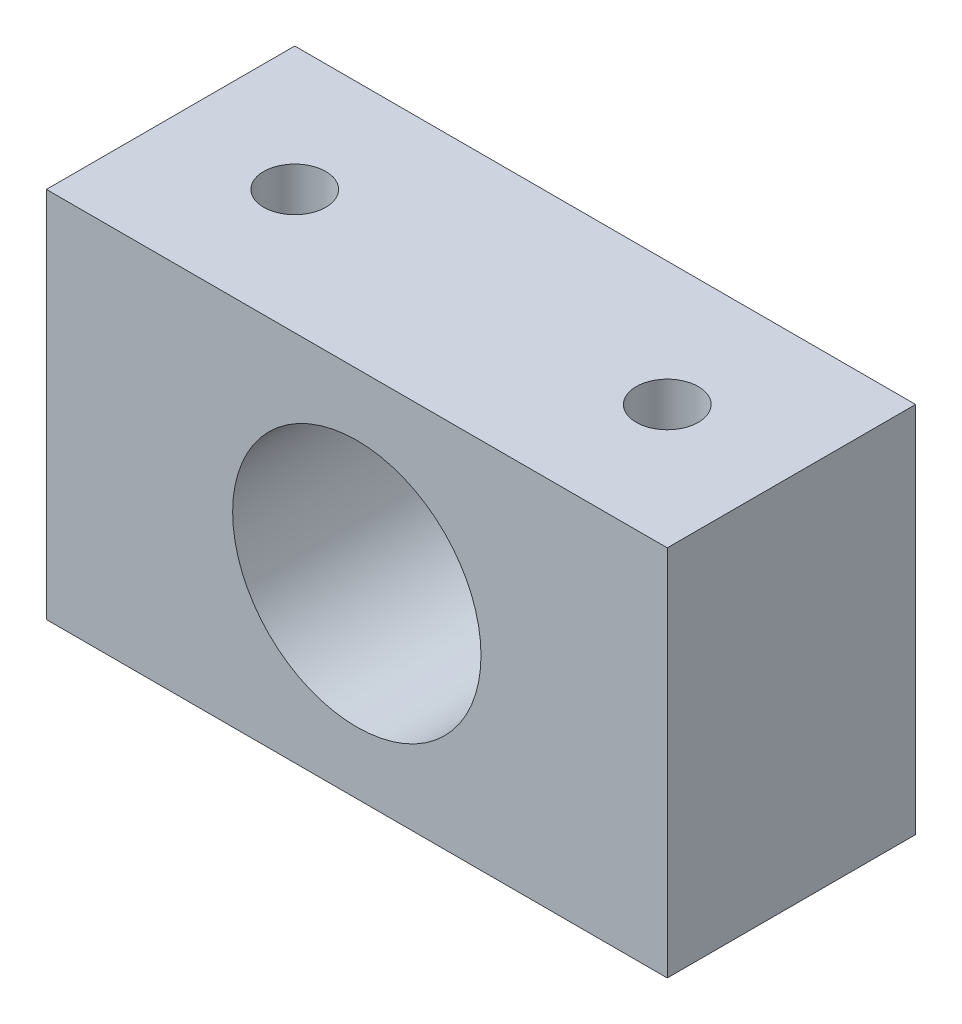
ISO-10303-21;
HEADER;
FILE_DESCRIPTION(('STEP AP214'),'2;1');
FILE_NAME('part.step','',(''),(''),'','','');
FILE_SCHEMA(('AUTOMOTIVE_DESIGN { 1 0 10303 214 1 1 1 1 }'));
ENDSEC;
DATA;
#1=APPLICATION_CONTEXT('core data for automotive mechanical design processes');
#2=APPLICATION_PROTOCOL_DEFINITION('international standard','automotive_design',2000,#1);
#3=PRODUCT_CONTEXT('',#1,'mechanical');
#4=PRODUCT('Part','Part','',(#3));
#5=PRODUCT_RELATED_PRODUCT_CATEGORY('part','',(#4));
#6=PRODUCT_DEFINITION_FORMATION('','',#4);
#7=PRODUCT_DEFINITION_CONTEXT('part definition',#1,'design');
#8=PRODUCT_DEFINITION('design','',#6,#7);
#9=PRODUCT_DEFINITION_SHAPE('','',#8);
#10=(LENGTH_UNIT() NAMED_UNIT(*) SI_UNIT(.MILLI.,.METRE.));
#11=(NAMED_UNIT(*) PLANE_ANGLE_UNIT() SI_UNIT($,.RADIAN.));
#12=(NAMED_UNIT(*) SI_UNIT($,.STERADIAN.) SOLID_ANGLE_UNIT());
#13=UNCERTAINTY_MEASURE_WITH_UNIT(LENGTH_MEASURE(1.E-05),#10,'distance_accuracy_value','');
#14=(GEOMETRIC_REPRESENTATION_CONTEXT(3) GLOBAL_UNCERTAINTY_ASSIGNED_CONTEXT((#13)) GLOBAL_UNIT_ASSIGNED_CONTEXT((#10,
#11,#12)) REPRESENTATION_CONTEXT('',''));
#15=CARTESIAN_POINT('',(0.,0.,0.));
#16=DIRECTION('',(0.,0.,1.));
#17=DIRECTION('',(1.,0.,0.));
#18=AXIS2_PLACEMENT_3D('',#15,#16,#17);
#19=CARTESIAN_POINT('',(-15.875,9.525,12.7));
#20=DIRECTION('',(1.,0.,0.));
#21=DIRECTION('',(0.,1.,0.));
#22=AXIS2_PLACEMENT_3D('',#19,#20,#21);
#23=PLANE('',#22);
#24=DIRECTION('',(0.,-1.,0.));
#25=VECTOR('',#24,1.);
#26=CARTESIAN_POINT('',(-15.875,9.525,0.));
#27=LINE('',#26,#25);
#28=CARTESIAN_POINT('',(-15.875,9.525,0.));
#29=VERTEX_POINT('',#28);
#30=CARTESIAN_POINT('',(-15.875,-9.525,0.));
#31=VERTEX_POINT('',#30);
#32=EDGE_CURVE('E96',#29,#31,#27,.T.);
#33=ORIENTED_EDGE('',*,*,#32,.T.);
#34=DIRECTION('',(0.,0.,-1.));
#35=VECTOR('',#34,1.);
#36=CARTESIAN_POINT('',(-15.875,-9.525,12.7));
#37=LINE('',#36,#35);
#38=CARTESIAN_POINT('',(-15.875,-9.525,12.7));
#39=VERTEX_POINT('',#38);
#40=EDGE_CURVE('E11',#39,#31,#37,.T.);
#41=ORIENTED_EDGE('',*,*,#40,.F.);
#42=DIRECTION('',(0.,-1.,0.));
#43=VECTOR('',#42,1.);
#44=CARTESIAN_POINT('',(-15.875,9.525,12.7));
#45=LINE('',#44,#43);
#46=CARTESIAN_POINT('',(-15.875,9.525,12.7));
#47=VERTEX_POINT('',#46);
#48=EDGE_CURVE('E84',#47,#39,#45,.T.);
#49=ORIENTED_EDGE('',*,*,#48,.F.);
#50=DIRECTION('',(0.,0.,-1.));
#51=VECTOR('',#50,1.);
#52=CARTESIAN_POINT('',(-15.875,9.525,12.7));
#53=LINE('',#52,#51);
#54=EDGE_CURVE('E92',#47,#29,#53,.T.);
#55=ORIENTED_EDGE('',*,*,#54,.T.);
#56=EDGE_LOOP('',(#33,#41,#49,#55));
#57=FACE_BOUND('',#56,.T.);
#58=ADVANCED_FACE('F33',(#57),#23,.F.);
#59=CARTESIAN_POINT('',(15.875,-9.525,12.7));
#60=DIRECTION('',(0.,1.,0.));
#61=DIRECTION('',(-1.,0.,0.));
#62=AXIS2_PLACEMENT_3D('',#59,#60,#61);
#63=PLANE('',#62);
#64=DIRECTION('',(1.,0.,0.));
#65=VECTOR('',#64,1.);
#66=CARTESIAN_POINT('',(15.875,-9.525,0.));
#67=LINE('',#66,#65);
#68=CARTESIAN_POINT('',(15.875,-9.525,0.));
#69=VERTEX_POINT('',#68);
#70=EDGE_CURVE('E88',#31,#69,#67,.T.);
#71=ORIENTED_EDGE('',*,*,#70,.T.);
#72=DIRECTION('',(0.,0.,-1.));
#73=VECTOR('',#72,1.);
#74=CARTESIAN_POINT('',(15.875,-9.525,12.7));
#75=LINE('',#74,#73);
#76=CARTESIAN_POINT('',(15.875,-9.525,12.7));
#77=VERTEX_POINT('',#76);
#78=EDGE_CURVE('E41',#77,#69,#75,.T.);
#79=ORIENTED_EDGE('',*,*,#78,.F.);
#80=DIRECTION('',(1.,0.,0.));
#81=VECTOR('',#80,1.);
#82=CARTESIAN_POINT('',(15.875,-9.525,12.7));
#83=LINE('',#82,#81);
#84=EDGE_CURVE('E79',#39,#77,#83,.T.);
#85=ORIENTED_EDGE('',*,*,#84,.F.);
#86=ORIENTED_EDGE('',*,*,#40,.T.);
#87=EDGE_LOOP('',(#71,#79,#85,#86));
#88=FACE_BOUND('',#87,.T.);
#89=ADVANCED_FACE('F87',(#88),#63,.F.);
#90=CARTESIAN_POINT('',(15.875,9.525,12.7));
#91=DIRECTION('',(-1.,0.,0.));
#92=DIRECTION('',(0.,-1.,0.));
#93=AXIS2_PLACEMENT_3D('',#90,#91,#92);
#94=PLANE('',#93);
#95=DIRECTION('',(0.,1.,0.));
#96=VECTOR('',#95,1.);
#97=CARTESIAN_POINT('',(15.875,9.525,0.));
#98=LINE('',#97,#96);
#99=CARTESIAN_POINT('',(15.875,9.525,0.));
#100=VERTEX_POINT('',#99);
#101=EDGE_CURVE('E66',#69,#100,#98,.T.);
#102=ORIENTED_EDGE('',*,*,#101,.T.);
#103=DIRECTION('',(0.,0.,-1.));
#104=VECTOR('',#103,1.);
#105=CARTESIAN_POINT('',(15.875,9.525,12.7));
#106=LINE('',#105,#104);
#107=CARTESIAN_POINT('',(15.875,9.525,12.7));
#108=VERTEX_POINT('',#107);
#109=EDGE_CURVE('E89',#108,#100,#106,.T.);
#110=ORIENTED_EDGE('',*,*,#109,.F.);
#111=DIRECTION('',(0.,1.,0.));
#112=VECTOR('',#111,1.);
#113=CARTESIAN_POINT('',(15.875,9.525,12.7));
#114=LINE('',#113,#112);
#115=EDGE_CURVE('E82',#77,#108,#114,.T.);
#116=ORIENTED_EDGE('',*,*,#115,.F.);
#117=ORIENTED_EDGE('',*,*,#78,.T.);
#118=EDGE_LOOP('',(#102,#110,#116,#117));
#119=FACE_BOUND('',#118,.T.);
#120=ADVANCED_FACE('F90',(#119),#94,.F.);
#121=CARTESIAN_POINT('',(15.875,9.525,12.7));
#122=DIRECTION('',(0.,-1.,0.));
#123=DIRECTION('',(1.,0.,0.));
#124=AXIS2_PLACEMENT_3D('',#121,#122,#123);
#125=PLANE('',#124);
#126=CARTESIAN_POINT('',(-9.52500000000001,9.525,6.35));
#127=DIRECTION('',(0.,1.,0.));
#128=DIRECTION('',(-1.,0.,0.));
#129=AXIS2_PLACEMENT_3D('',#126,#127,#128);
#130=CIRCLE('',#129,1.5875);
#131=CARTESIAN_POINT('',(-11.1125,9.525,6.35));
#132=VERTEX_POINT('',#131);
#133=EDGE_CURVE('E122',#132,#132,#130,.T.);
#134=ORIENTED_EDGE('',*,*,#133,.F.);
#135=EDGE_LOOP('',(#134));
#136=FACE_BOUND('',#135,.T.);
#137=CARTESIAN_POINT('',(9.525,9.525,6.35));
#138=DIRECTION('',(0.,1.,0.));
#139=DIRECTION('',(-1.,0.,0.));
#140=AXIS2_PLACEMENT_3D('',#137,#138,#139);
#141=CIRCLE('',#140,1.5875);
#142=CARTESIAN_POINT('',(7.9375,9.525,6.35));
#143=VERTEX_POINT('',#142);
#144=EDGE_CURVE('E116',#143,#143,#141,.T.);
#145=ORIENTED_EDGE('',*,*,#144,.F.);
#146=EDGE_LOOP('',(#145));
#147=FACE_BOUND('',#146,.T.);
#148=DIRECTION('',(-1.,0.,0.));
#149=VECTOR('',#148,1.);
#150=CARTESIAN_POINT('',(15.875,9.525,0.));
#151=LINE('',#150,#149);
#152=EDGE_CURVE('E72',#100,#29,#151,.T.);
#153=ORIENTED_EDGE('',*,*,#152,.T.);
#154=ORIENTED_EDGE('',*,*,#54,.F.);
#155=DIRECTION('',(-1.,0.,0.));
#156=VECTOR('',#155,1.);
#157=CARTESIAN_POINT('',(15.875,9.525,12.7));
#158=LINE('',#157,#156);
#159=EDGE_CURVE('E49',#108,#47,#158,.T.);
#160=ORIENTED_EDGE('',*,*,#159,.F.);
#161=ORIENTED_EDGE('',*,*,#109,.T.);
#162=EDGE_LOOP('',(#153,#154,#160,#161));
#163=FACE_BOUND('',#162,.T.);
#164=ADVANCED_FACE('F104',(#136,#147,#163),#125,.F.);
#165=CARTESIAN_POINT('',(0.,0.,12.7));
#166=DIRECTION('',(0.,0.,-1.));
#167=DIRECTION('',(-1.,0.,0.));
#168=AXIS2_PLACEMENT_3D('',#165,#166,#167);
#169=PLANE('',#168);
#170=CARTESIAN_POINT('',(0.,0.,12.7));
#171=DIRECTION('',(0.,0.,1.));
#172=DIRECTION('',(1.,0.,0.));
#173=AXIS2_PLACEMENT_3D('',#170,#171,#172);
#174=CIRCLE('',#173,6.35);
#175=CARTESIAN_POINT('',(6.35,0.,12.7));
#176=VERTEX_POINT('',#175);
#177=EDGE_CURVE('E110',#176,#176,#174,.T.);
#178=ORIENTED_EDGE('',*,*,#177,.F.);
#179=EDGE_LOOP('',(#178));
#180=FACE_BOUND('',#179,.T.);
#181=ORIENTED_EDGE('',*,*,#48,.T.);
#182=ORIENTED_EDGE('',*,*,#84,.T.);
#183=ORIENTED_EDGE('',*,*,#115,.T.);
#184=ORIENTED_EDGE('',*,*,#159,.T.);
#185=EDGE_LOOP('',(#181,#182,#183,#184));
#186=FACE_BOUND('',#185,.T.);
#187=ADVANCED_FACE('F80',(#180,#186),#169,.F.);
#188=CARTESIAN_POINT('',(0.,0.,0.));
#189=DIRECTION('',(0.,0.,-1.));
#190=DIRECTION('',(-1.,0.,0.));
#191=AXIS2_PLACEMENT_3D('',#188,#189,#190);
#192=PLANE('',#191);
#193=CARTESIAN_POINT('',(0.,0.,0.));
#194=DIRECTION('',(0.,0.,1.));
#195=DIRECTION('',(1.,0.,0.));
#196=AXIS2_PLACEMENT_3D('',#193,#194,#195);
#197=CIRCLE('',#196,6.35);
#198=CARTESIAN_POINT('',(6.35,0.,0.));
#199=VERTEX_POINT('',#198);
#200=EDGE_CURVE('E99',#199,#199,#197,.T.);
#201=ORIENTED_EDGE('',*,*,#200,.T.);
#202=EDGE_LOOP('',(#201));
#203=FACE_BOUND('',#202,.T.);
#204=ORIENTED_EDGE('',*,*,#32,.F.);
#205=ORIENTED_EDGE('',*,*,#152,.F.);
#206=ORIENTED_EDGE('',*,*,#101,.F.);
#207=ORIENTED_EDGE('',*,*,#70,.F.);
#208=EDGE_LOOP('',(#204,#205,#206,#207));
#209=FACE_BOUND('',#208,.T.);
#210=ADVANCED_FACE('F107',(#203,#209),#192,.T.);
#211=CARTESIAN_POINT('',(0.,0.,0.));
#212=DIRECTION('',(0.,0.,1.));
#213=DIRECTION('',(1.,0.,0.));
#214=AXIS2_PLACEMENT_3D('',#211,#212,#213);
#215=CYLINDRICAL_SURFACE('',#214,6.35);
#216=ORIENTED_EDGE('',*,*,#200,.F.);
#217=EDGE_LOOP('',(#216));
#218=FACE_BOUND('',#217,.T.);
#219=ORIENTED_EDGE('',*,*,#177,.T.);
#220=EDGE_LOOP('',(#219));
#221=FACE_BOUND('',#220,.T.);
#222=ADVANCED_FACE('F144',(#218,#221),#215,.F.);
#223=CARTESIAN_POINT('',(9.525,-3.175,6.35));
#224=DIRECTION('',(0.,1.,0.));
#225=DIRECTION('',(-1.,0.,0.));
#226=AXIS2_PLACEMENT_3D('',#223,#224,#225);
#227=CYLINDRICAL_SURFACE('',#226,1.5875);
#228=CARTESIAN_POINT('',(9.525,-3.175,6.35));
#229=DIRECTION('',(0.,1.,0.));
#230=DIRECTION('',(-1.,0.,0.));
#231=AXIS2_PLACEMENT_3D('',#228,#229,#230);
#232=CIRCLE('',#231,1.5875);
#233=CARTESIAN_POINT('',(7.9375,-3.175,6.35));
#234=VERTEX_POINT('',#233);
#235=EDGE_CURVE('E119',#234,#234,#232,.T.);
#236=ORIENTED_EDGE('',*,*,#235,.F.);
#237=EDGE_LOOP('',(#236));
#238=FACE_BOUND('',#237,.T.);
#239=ORIENTED_EDGE('',*,*,#144,.T.);
#240=EDGE_LOOP('',(#239));
#241=FACE_BOUND('',#240,.T.);
#242=ADVANCED_FACE('F142',(#238,#241),#227,.F.);
#243=CARTESIAN_POINT('',(9.525,-3.175,6.35));
#244=DIRECTION('',(0.,1.,0.));
#245=DIRECTION('',(-1.,0.,0.));
#246=AXIS2_PLACEMENT_3D('',#243,#244,#245);
#247=PLANE('',#246);
#248=ORIENTED_EDGE('',*,*,#235,.T.);
#249=EDGE_LOOP('',(#248));
#250=FACE_BOUND('',#249,.T.);
#251=ADVANCED_FACE('F133',(#250),#247,.T.);
#252=CARTESIAN_POINT('',(-9.525,-3.175,6.35));
#253=DIRECTION('',(0.,1.,0.));
#254=DIRECTION('',(-1.,0.,0.));
#255=AXIS2_PLACEMENT_3D('',#252,#253,#254);
#256=CYLINDRICAL_SURFACE('',#255,1.5875);
#257=CARTESIAN_POINT('',(-9.525,-3.175,6.35));
#258=DIRECTION('',(0.,1.,0.));
#259=DIRECTION('',(-1.,0.,0.));
#260=AXIS2_PLACEMENT_3D('',#257,#258,#259);
#261=CIRCLE('',#260,1.5875);
#262=CARTESIAN_POINT('',(-11.1125,-3.175,6.35));
#263=VERTEX_POINT('',#262);
#264=EDGE_CURVE('E113',#263,#263,#261,.T.);
#265=ORIENTED_EDGE('',*,*,#264,.F.);
#266=EDGE_LOOP('',(#265));
#267=FACE_BOUND('',#266,.T.);
#268=ORIENTED_EDGE('',*,*,#133,.T.);
#269=EDGE_LOOP('',(#268));
#270=FACE_BOUND('',#269,.T.);
#271=ADVANCED_FACE('F130',(#267,#270),#256,.F.);
#272=CARTESIAN_POINT('',(-9.525,-3.175,6.35));
#273=DIRECTION('',(0.,1.,0.));
#274=DIRECTION('',(-1.,0.,0.));
#275=AXIS2_PLACEMENT_3D('',#272,#273,#274);
#276=PLANE('',#275);
#277=ORIENTED_EDGE('',*,*,#264,.T.);
#278=EDGE_LOOP('',(#277));
#279=FACE_BOUND('',#278,.T.);
#280=ADVANCED_FACE('F128',(#279),#276,.T.);
#281=CLOSED_SHELL('',(#58,#89,#120,#164,#187,#210,#222,#242,#251,#271,#280));
#282=MANIFOLD_SOLID_BREP('B2',#281);
#283=ADVANCED_BREP_SHAPE_REPRESENTATION('',(#18,#282),#14);
#284=SHAPE_DEFINITION_REPRESENTATION(#9,#283);
ENDSEC;
END-ISO-10303-21;
